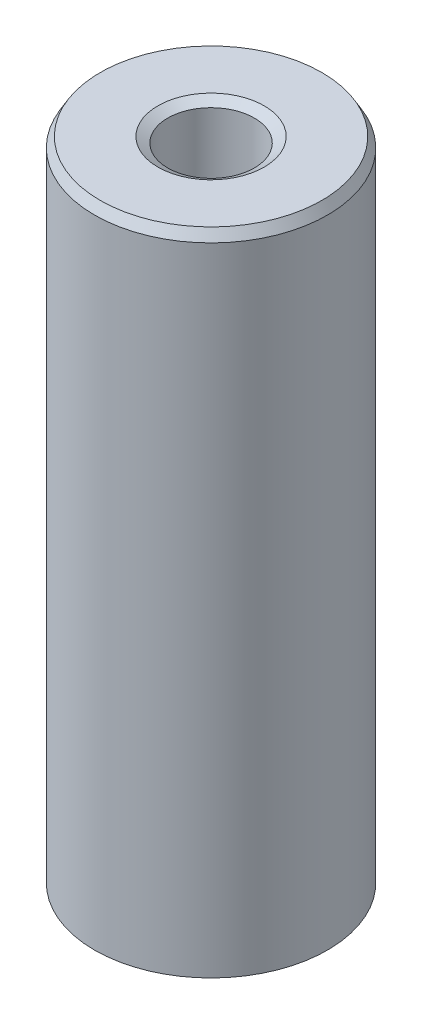
ISO-10303-21;
HEADER;
FILE_DESCRIPTION(('STEP AP214'),'2;1');
FILE_NAME('part.step','',(''),(''),'','','');
FILE_SCHEMA(('AUTOMOTIVE_DESIGN { 1 0 10303 214 1 1 1 1 }'));
ENDSEC;
DATA;
#1=APPLICATION_CONTEXT('core data for automotive mechanical design processes');
#2=APPLICATION_PROTOCOL_DEFINITION('international standard','automotive_design',2000,#1);
#3=PRODUCT_CONTEXT('',#1,'mechanical');
#4=PRODUCT('Part','Part','',(#3));
#5=PRODUCT_RELATED_PRODUCT_CATEGORY('part','',(#4));
#6=PRODUCT_DEFINITION_FORMATION('','',#4);
#7=PRODUCT_DEFINITION_CONTEXT('part definition',#1,'design');
#8=PRODUCT_DEFINITION('design','',#6,#7);
#9=PRODUCT_DEFINITION_SHAPE('','',#8);
#10=(LENGTH_UNIT() NAMED_UNIT(*) SI_UNIT(.MILLI.,.METRE.));
#11=(NAMED_UNIT(*) PLANE_ANGLE_UNIT() SI_UNIT($,.RADIAN.));
#12=(NAMED_UNIT(*) SI_UNIT($,.STERADIAN.) SOLID_ANGLE_UNIT());
#13=UNCERTAINTY_MEASURE_WITH_UNIT(LENGTH_MEASURE(1.E-05),#10,'distance_accuracy_value','');
#14=(GEOMETRIC_REPRESENTATION_CONTEXT(3) GLOBAL_UNCERTAINTY_ASSIGNED_CONTEXT((#13)) GLOBAL_UNIT_ASSIGNED_CONTEXT((#10,
#11,#12)) REPRESENTATION_CONTEXT('',''));
#15=CARTESIAN_POINT('',(0.,0.,0.));
#16=DIRECTION('',(0.,0.,1.));
#17=DIRECTION('',(1.,0.,0.));
#18=AXIS2_PLACEMENT_3D('',#15,#16,#17);
#19=CARTESIAN_POINT('',(0.,125.94270238024,0.));
#20=DIRECTION('',(0.,-1.,0.));
#21=DIRECTION('',(0.,0.,-1.));
#22=AXIS2_PLACEMENT_3D('',#19,#20,#21);
#23=CYLINDRICAL_SURFACE('',#22,22.5);
#24=CARTESIAN_POINT('',(0.,1.0963287627218,0.));
#25=DIRECTION('',(0.,1.,0.));
#26=DIRECTION('',(0.,0.,1.));
#27=AXIS2_PLACEMENT_3D('',#24,#25,#26);
#28=CIRCLE('',#27,22.5);
#29=CARTESIAN_POINT('',(0.,1.0963287627218,22.5));
#30=VERTEX_POINT('',#29);
#31=EDGE_CURVE('E10',#30,#30,#28,.T.);
#32=ORIENTED_EDGE('',*,*,#31,.T.);
#33=EDGE_LOOP('',(#32));
#34=FACE_BOUND('',#33,.T.);
#35=CARTESIAN_POINT('',(0.,124.043805261406,0.));
#36=DIRECTION('',(0.,1.,0.));
#37=DIRECTION('',(0.,0.,1.));
#38=AXIS2_PLACEMENT_3D('',#35,#36,#37);
#39=CIRCLE('',#38,22.5);
#40=CARTESIAN_POINT('',(0.,124.043805261406,22.5));
#41=VERTEX_POINT('',#40);
#42=EDGE_CURVE('E50',#41,#41,#39,.F.);
#43=ORIENTED_EDGE('',*,*,#42,.T.);
#44=EDGE_LOOP('',(#43));
#45=FACE_BOUND('',#44,.T.);
#46=ADVANCED_FACE('F39',(#34,#45),#23,.T.);
#47=CARTESIAN_POINT('',(0.,125.94270238024,0.));
#48=DIRECTION('',(0.,1.,0.));
#49=DIRECTION('',(0.,0.,1.));
#50=AXIS2_PLACEMENT_3D('',#47,#48,#49);
#51=PLANE('',#50);
#52=CARTESIAN_POINT('',(0.,125.94270238024,0.));
#53=DIRECTION('',(0.,1.,0.));
#54=DIRECTION('',(0.,0.,1.));
#55=AXIS2_PLACEMENT_3D('',#52,#53,#54);
#56=CIRCLE('',#55,10.2631613396464);
#57=CARTESIAN_POINT('',(0.,125.94270238024,10.2631613396464));
#58=VERTEX_POINT('',#57);
#59=EDGE_CURVE('E58',#58,#58,#56,.F.);
#60=ORIENTED_EDGE('',*,*,#59,.T.);
#61=EDGE_LOOP('',(#60));
#62=FACE_BOUND('',#61,.T.);
#63=CARTESIAN_POINT('',(0.,125.94270238024,0.));
#64=DIRECTION('',(0.,1.,0.));
#65=DIRECTION('',(0.,0.,1.));
#66=AXIS2_PLACEMENT_3D('',#63,#64,#65);
#67=CIRCLE('',#66,21.4036712372782);
#68=CARTESIAN_POINT('',(0.,125.94270238024,21.4036712372782));
#69=VERTEX_POINT('',#68);
#70=EDGE_CURVE('E61',#69,#69,#67,.T.);
#71=ORIENTED_EDGE('',*,*,#70,.T.);
#72=EDGE_LOOP('',(#71));
#73=FACE_BOUND('',#72,.T.);
#74=ADVANCED_FACE('F88',(#62,#73),#51,.T.);
#75=CARTESIAN_POINT('',(0.,0.,0.));
#76=DIRECTION('',(0.,1.,0.));
#77=DIRECTION('',(0.,0.,1.));
#78=AXIS2_PLACEMENT_3D('',#75,#76,#77);
#79=PLANE('',#78);
#80=CARTESIAN_POINT('',(0.,0.,0.));
#81=DIRECTION('',(0.,1.,0.));
#82=DIRECTION('',(0.,0.,1.));
#83=AXIS2_PLACEMENT_3D('',#80,#81,#82);
#84=CIRCLE('',#83,9.46059298353494);
#85=CARTESIAN_POINT('',(0.,0.,9.46059298353494));
#86=VERTEX_POINT('',#85);
#87=EDGE_CURVE('E51',#86,#86,#84,.T.);
#88=ORIENTED_EDGE('',*,*,#87,.T.);
#89=EDGE_LOOP('',(#88));
#90=FACE_BOUND('',#89,.T.);
#91=CARTESIAN_POINT('',(0.,0.,0.));
#92=DIRECTION('',(0.,1.,0.));
#93=DIRECTION('',(0.,0.,1.));
#94=AXIS2_PLACEMENT_3D('',#91,#92,#93);
#95=CIRCLE('',#94,20.6011028811667);
#96=CARTESIAN_POINT('',(0.,0.,20.6011028811667));
#97=VERTEX_POINT('',#96);
#98=EDGE_CURVE('E54',#97,#97,#95,.F.);
#99=ORIENTED_EDGE('',*,*,#98,.T.);
#100=EDGE_LOOP('',(#99));
#101=FACE_BOUND('',#100,.T.);
#102=ADVANCED_FACE('F83',(#90,#101),#79,.F.);
#103=CARTESIAN_POINT('',(0.,125.94270238024,0.));
#104=DIRECTION('',(0.,-1.,0.));
#105=DIRECTION('',(0.,0.,-1.));
#106=AXIS2_PLACEMENT_3D('',#103,#104,#105);
#107=CYLINDRICAL_SURFACE('',#106,8.36426422081314);
#108=CARTESIAN_POINT('',(0.,124.846373617518,0.));
#109=DIRECTION('',(0.,1.,0.));
#110=DIRECTION('',(0.,0.,1.));
#111=AXIS2_PLACEMENT_3D('',#108,#109,#110);
#112=CIRCLE('',#111,8.36426422081314);
#113=CARTESIAN_POINT('',(0.,124.846373617518,8.36426422081314));
#114=VERTEX_POINT('',#113);
#115=EDGE_CURVE('E67',#114,#114,#112,.T.);
#116=ORIENTED_EDGE('',*,*,#115,.T.);
#117=EDGE_LOOP('',(#116));
#118=FACE_BOUND('',#117,.T.);
#119=CARTESIAN_POINT('',(0.,1.89889711883333,0.));
#120=DIRECTION('',(0.,1.,0.));
#121=DIRECTION('',(0.,0.,1.));
#122=AXIS2_PLACEMENT_3D('',#119,#120,#121);
#123=CIRCLE('',#122,8.36426422081314);
#124=CARTESIAN_POINT('',(0.,1.89889711883333,8.36426422081314));
#125=VERTEX_POINT('',#124);
#126=EDGE_CURVE('E69',#125,#125,#123,.F.);
#127=ORIENTED_EDGE('',*,*,#126,.T.);
#128=EDGE_LOOP('',(#127));
#129=FACE_BOUND('',#128,.T.);
#130=ADVANCED_FACE('F71',(#118,#129),#107,.F.);
#131=CARTESIAN_POINT('',(0.,124.846373617518,0.));
#132=DIRECTION('',(0.,1.,0.));
#133=DIRECTION('',(0.,0.,1.));
#134=AXIS2_PLACEMENT_3D('',#131,#132,#133);
#135=CONICAL_SURFACE('',#134,8.36426422081314,1.0471975511966);
#136=ORIENTED_EDGE('',*,*,#59,.F.);
#137=EDGE_LOOP('',(#136));
#138=FACE_BOUND('',#137,.T.);
#139=ORIENTED_EDGE('',*,*,#115,.F.);
#140=EDGE_LOOP('',(#139));
#141=FACE_BOUND('',#140,.T.);
#142=ADVANCED_FACE('F77',(#138,#141),#135,.F.);
#143=CARTESIAN_POINT('',(0.,0.,0.));
#144=DIRECTION('',(0.,-1.,0.));
#145=DIRECTION('',(0.,0.,-1.));
#146=AXIS2_PLACEMENT_3D('',#143,#144,#145);
#147=CONICAL_SURFACE('',#146,9.46059298353494,0.523598775598292);
#148=ORIENTED_EDGE('',*,*,#126,.F.);
#149=EDGE_LOOP('',(#148));
#150=FACE_BOUND('',#149,.T.);
#151=ORIENTED_EDGE('',*,*,#87,.F.);
#152=EDGE_LOOP('',(#151));
#153=FACE_BOUND('',#152,.T.);
#154=ADVANCED_FACE('F73',(#150,#153),#147,.F.);
#155=CARTESIAN_POINT('',(0.,1.0963287627218,0.));
#156=DIRECTION('',(0.,1.,0.));
#157=DIRECTION('',(0.,0.,1.));
#158=AXIS2_PLACEMENT_3D('',#155,#156,#157);
#159=CONICAL_SURFACE('',#158,22.5,1.0471975511966);
#160=ORIENTED_EDGE('',*,*,#98,.F.);
#161=EDGE_LOOP('',(#160));
#162=FACE_BOUND('',#161,.T.);
#163=ORIENTED_EDGE('',*,*,#31,.F.);
#164=EDGE_LOOP('',(#163));
#165=FACE_BOUND('',#164,.T.);
#166=ADVANCED_FACE('F76',(#162,#165),#159,.T.);
#167=CARTESIAN_POINT('',(0.,125.94270238024,0.));
#168=DIRECTION('',(0.,-1.,0.));
#169=DIRECTION('',(0.,0.,-1.));
#170=AXIS2_PLACEMENT_3D('',#167,#168,#169);
#171=CONICAL_SURFACE('',#170,21.4036712372782,0.523598775598291);
#172=ORIENTED_EDGE('',*,*,#42,.F.);
#173=EDGE_LOOP('',(#172));
#174=FACE_BOUND('',#173,.T.);
#175=ORIENTED_EDGE('',*,*,#70,.F.);
#176=EDGE_LOOP('',(#175));
#177=FACE_BOUND('',#176,.T.);
#178=ADVANCED_FACE('F45',(#174,#177),#171,.T.);
#179=CLOSED_SHELL('',(#46,#74,#102,#130,#142,#154,#166,#178));
#180=MANIFOLD_SOLID_BREP('B2',#179);
#181=ADVANCED_BREP_SHAPE_REPRESENTATION('',(#18,#180),#14);
#182=SHAPE_DEFINITION_REPRESENTATION(#9,#181);
ENDSEC;
END-ISO-10303-21;
